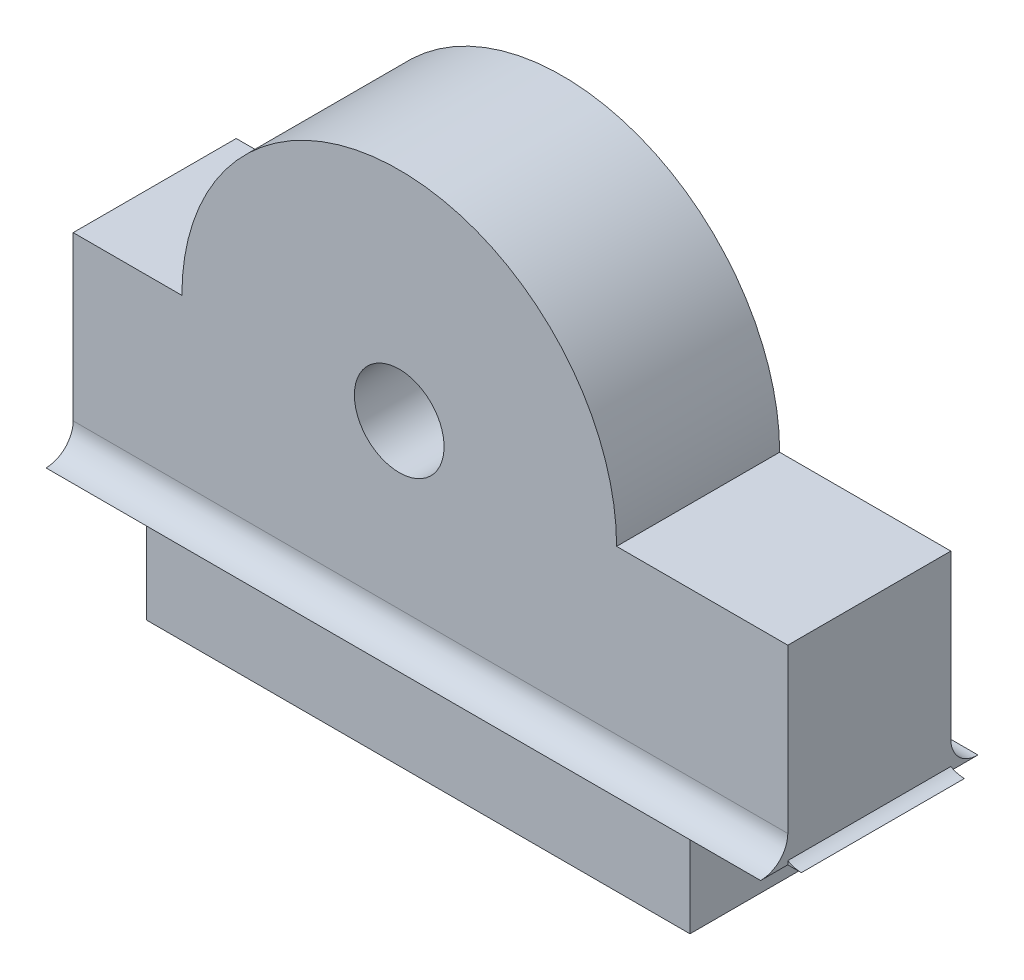
ISO-10303-21;
HEADER;
FILE_DESCRIPTION(('STEP AP214'),'2;1');
FILE_NAME('part.step','',(''),(''),'','','');
FILE_SCHEMA(('AUTOMOTIVE_DESIGN { 1 0 10303 214 1 1 1 1 }'));
ENDSEC;
DATA;
#1=APPLICATION_CONTEXT('core data for automotive mechanical design processes');
#2=APPLICATION_PROTOCOL_DEFINITION('international standard','automotive_design',2000,#1);
#3=PRODUCT_CONTEXT('',#1,'mechanical');
#4=PRODUCT('Part','Part','',(#3));
#5=PRODUCT_RELATED_PRODUCT_CATEGORY('part','',(#4));
#6=PRODUCT_DEFINITION_FORMATION('','',#4);
#7=PRODUCT_DEFINITION_CONTEXT('part definition',#1,'design');
#8=PRODUCT_DEFINITION('design','',#6,#7);
#9=PRODUCT_DEFINITION_SHAPE('','',#8);
#10=(LENGTH_UNIT() NAMED_UNIT(*) SI_UNIT(.MILLI.,.METRE.));
#11=(NAMED_UNIT(*) PLANE_ANGLE_UNIT() SI_UNIT($,.RADIAN.));
#12=(NAMED_UNIT(*) SI_UNIT($,.STERADIAN.) SOLID_ANGLE_UNIT());
#13=UNCERTAINTY_MEASURE_WITH_UNIT(LENGTH_MEASURE(1.E-05),#10,'distance_accuracy_value','');
#14=(GEOMETRIC_REPRESENTATION_CONTEXT(3) GLOBAL_UNCERTAINTY_ASSIGNED_CONTEXT((#13)) GLOBAL_UNIT_ASSIGNED_CONTEXT((#10,
#11,#12)) REPRESENTATION_CONTEXT('',''));
#15=CARTESIAN_POINT('',(0.,0.,0.));
#16=DIRECTION('',(0.,0.,1.));
#17=DIRECTION('',(1.,0.,0.));
#18=AXIS2_PLACEMENT_3D('',#15,#16,#17);
#19=CARTESIAN_POINT('',(9.3,11.,0.));
#20=DIRECTION('',(0.,0.,1.));
#21=DIRECTION('',(1.,0.,0.));
#22=AXIS2_PLACEMENT_3D('',#19,#20,#21);
#23=PLANE('',#22);
#24=CARTESIAN_POINT('',(9.3,11.,0.));
#25=DIRECTION('',(0.,0.,1.));
#26=DIRECTION('',(1.,0.,0.));
#27=AXIS2_PLACEMENT_3D('',#24,#25,#26);
#28=CIRCLE('',#27,2.9);
#29=CARTESIAN_POINT('',(12.2,11.,0.));
#30=VERTEX_POINT('',#29);
#31=EDGE_CURVE('E217',#30,#30,#28,.T.);
#32=ORIENTED_EDGE('',*,*,#31,.T.);
#33=EDGE_LOOP('',(#32));
#34=FACE_BOUND('',#33,.T.);
#35=DIRECTION('',(-1.,0.,0.));
#36=VECTOR('',#35,1.);
#37=CARTESIAN_POINT('',(25.0142135623731,5.,0.));
#38=LINE('',#37,#36);
#39=CARTESIAN_POINT('',(23.6,5.,0.));
#40=VERTEX_POINT('',#39);
#41=CARTESIAN_POINT('',(23.1,5.,0.));
#42=VERTEX_POINT('',#41);
#43=EDGE_CURVE('E191',#40,#42,#38,.T.);
#44=ORIENTED_EDGE('',*,*,#43,.T.);
#45=CARTESIAN_POINT('',(-1.49999999999999,5.,0.));
#46=VERTEX_POINT('',#45);
#47=EDGE_CURVE('E197',#42,#46,#38,.T.);
#48=ORIENTED_EDGE('',*,*,#47,.T.);
#49=CARTESIAN_POINT('',(-2.7,5.,0.));
#50=VERTEX_POINT('',#49);
#51=EDGE_CURVE('E58',#46,#50,#38,.T.);
#52=ORIENTED_EDGE('',*,*,#51,.T.);
#53=DIRECTION('',(0.,-1.,0.));
#54=VECTOR('',#53,1.);
#55=CARTESIAN_POINT('',(-2.7,4.,0.));
#56=LINE('',#55,#54);
#57=CARTESIAN_POINT('',(-2.70000000000001,11.,0.));
#58=VERTEX_POINT('',#57);
#59=EDGE_CURVE('E225',#58,#50,#56,.T.);
#60=ORIENTED_EDGE('',*,*,#59,.F.);
#61=DIRECTION('',(-1.,0.,0.));
#62=VECTOR('',#61,1.);
#63=CARTESIAN_POINT('',(-2.70000000000001,11.,0.));
#64=LINE('',#63,#62);
#65=CARTESIAN_POINT('',(1.29999999999999,11.,0.));
#66=VERTEX_POINT('',#65);
#67=EDGE_CURVE('E253',#66,#58,#64,.T.);
#68=ORIENTED_EDGE('',*,*,#67,.F.);
#69=CARTESIAN_POINT('',(9.3,11.,0.));
#70=DIRECTION('',(0.,0.,1.));
#71=DIRECTION('',(1.,0.,0.));
#72=AXIS2_PLACEMENT_3D('',#69,#70,#71);
#73=CIRCLE('',#72,8.);
#74=CARTESIAN_POINT('',(17.3,11.,0.));
#75=VERTEX_POINT('',#74);
#76=EDGE_CURVE('E251',#75,#66,#73,.T.);
#77=ORIENTED_EDGE('',*,*,#76,.F.);
#78=DIRECTION('',(-1.,0.,0.));
#79=VECTOR('',#78,1.);
#80=CARTESIAN_POINT('',(17.3,11.,0.));
#81=LINE('',#80,#79);
#82=CARTESIAN_POINT('',(23.6,11.,0.));
#83=VERTEX_POINT('',#82);
#84=EDGE_CURVE('E249',#83,#75,#81,.T.);
#85=ORIENTED_EDGE('',*,*,#84,.F.);
#86=DIRECTION('',(0.,1.,0.));
#87=VECTOR('',#86,1.);
#88=CARTESIAN_POINT('',(23.6,11.,0.));
#89=LINE('',#88,#87);
#90=EDGE_CURVE('E247',#40,#83,#89,.T.);
#91=ORIENTED_EDGE('',*,*,#90,.F.);
#92=EDGE_LOOP('',(#44,#48,#52,#60,#68,#77,#85,#91));
#93=FACE_BOUND('',#92,.T.);
#94=ADVANCED_FACE('F35',(#34,#93),#23,.F.);
#95=CARTESIAN_POINT('',(9.3,11.,6.));
#96=DIRECTION('',(0.,0.,1.));
#97=DIRECTION('',(1.,0.,0.));
#98=AXIS2_PLACEMENT_3D('',#95,#96,#97);
#99=PLANE('',#98);
#100=DIRECTION('',(0.,-1.,0.));
#101=VECTOR('',#100,1.);
#102=CARTESIAN_POINT('',(-2.7,4.,6.));
#103=LINE('',#102,#101);
#104=CARTESIAN_POINT('',(-2.70000000000001,11.,6.));
#105=VERTEX_POINT('',#104);
#106=CARTESIAN_POINT('',(-2.7,5.,6.));
#107=VERTEX_POINT('',#106);
#108=EDGE_CURVE('E237',#105,#107,#103,.T.);
#109=ORIENTED_EDGE('',*,*,#108,.T.);
#110=DIRECTION('',(-1.,0.,0.));
#111=VECTOR('',#110,1.);
#112=CARTESIAN_POINT('',(25.0142135623731,5.,6.));
#113=LINE('',#112,#111);
#114=CARTESIAN_POINT('',(-1.49999999999999,5.,6.));
#115=VERTEX_POINT('',#114);
#116=EDGE_CURVE('E50',#115,#107,#113,.T.);
#117=ORIENTED_EDGE('',*,*,#116,.F.);
#118=CARTESIAN_POINT('',(23.1,5.,6.));
#119=VERTEX_POINT('',#118);
#120=EDGE_CURVE('E212',#119,#115,#113,.T.);
#121=ORIENTED_EDGE('',*,*,#120,.F.);
#122=CARTESIAN_POINT('',(23.6,5.,6.));
#123=VERTEX_POINT('',#122);
#124=EDGE_CURVE('E209',#123,#119,#113,.T.);
#125=ORIENTED_EDGE('',*,*,#124,.F.);
#126=DIRECTION('',(0.,1.,0.));
#127=VECTOR('',#126,1.);
#128=CARTESIAN_POINT('',(23.6,11.,6.));
#129=LINE('',#128,#127);
#130=CARTESIAN_POINT('',(23.6,11.,6.));
#131=VERTEX_POINT('',#130);
#132=EDGE_CURVE('E229',#123,#131,#129,.T.);
#133=ORIENTED_EDGE('',*,*,#132,.T.);
#134=DIRECTION('',(-1.,0.,0.));
#135=VECTOR('',#134,1.);
#136=CARTESIAN_POINT('',(17.3,11.,6.));
#137=LINE('',#136,#135);
#138=CARTESIAN_POINT('',(17.3,11.,6.));
#139=VERTEX_POINT('',#138);
#140=EDGE_CURVE('E231',#131,#139,#137,.T.);
#141=ORIENTED_EDGE('',*,*,#140,.T.);
#142=CARTESIAN_POINT('',(9.3,11.,6.));
#143=DIRECTION('',(0.,0.,1.));
#144=DIRECTION('',(1.,0.,0.));
#145=AXIS2_PLACEMENT_3D('',#142,#143,#144);
#146=CIRCLE('',#145,8.);
#147=CARTESIAN_POINT('',(1.29999999999999,11.,6.));
#148=VERTEX_POINT('',#147);
#149=EDGE_CURVE('E233',#139,#148,#146,.T.);
#150=ORIENTED_EDGE('',*,*,#149,.T.);
#151=DIRECTION('',(-1.,0.,0.));
#152=VECTOR('',#151,1.);
#153=CARTESIAN_POINT('',(-2.70000000000001,11.,6.));
#154=LINE('',#153,#152);
#155=EDGE_CURVE('E235',#148,#105,#154,.T.);
#156=ORIENTED_EDGE('',*,*,#155,.T.);
#157=EDGE_LOOP('',(#109,#117,#121,#125,#133,#141,#150,#156));
#158=FACE_BOUND('',#157,.T.);
#159=CARTESIAN_POINT('',(9.3,11.,6.));
#160=DIRECTION('',(0.,0.,-1.));
#161=DIRECTION('',(-1.,0.,0.));
#162=AXIS2_PLACEMENT_3D('',#159,#160,#161);
#163=CIRCLE('',#162,1.65);
#164=CARTESIAN_POINT('',(7.65,11.,6.));
#165=VERTEX_POINT('',#164);
#166=EDGE_CURVE('E487',#165,#165,#163,.T.);
#167=ORIENTED_EDGE('',*,*,#166,.T.);
#168=EDGE_LOOP('',(#167));
#169=FACE_BOUND('',#168,.T.);
#170=ADVANCED_FACE('F301',(#158,#169),#99,.T.);
#171=DIRECTION('',(-1.,0.,0.));
#172=VECTOR('',#171,1.);
#173=CARTESIAN_POINT('',(25.0142135623731,4.,6.));
#174=LINE('',#173,#172);
#175=CARTESIAN_POINT('',(20.,4.,6.));
#176=VERTEX_POINT('',#175);
#177=CARTESIAN_POINT('',(0.,4.,6.));
#178=VERTEX_POINT('',#177);
#179=EDGE_CURVE('E205',#176,#178,#174,.T.);
#180=ORIENTED_EDGE('',*,*,#179,.T.);
#181=DIRECTION('',(0.,-1.,0.));
#182=VECTOR('',#181,1.);
#183=CARTESIAN_POINT('',(0.,0.,6.));
#184=LINE('',#183,#182);
#185=CARTESIAN_POINT('',(0.,0.,6.));
#186=VERTEX_POINT('',#185);
#187=EDGE_CURVE('E221',#178,#186,#184,.T.);
#188=ORIENTED_EDGE('',*,*,#187,.T.);
#189=DIRECTION('',(1.,0.,0.));
#190=VECTOR('',#189,1.);
#191=CARTESIAN_POINT('',(0.,0.,6.));
#192=LINE('',#191,#190);
#193=CARTESIAN_POINT('',(20.,0.,6.));
#194=VERTEX_POINT('',#193);
#195=EDGE_CURVE('E224',#186,#194,#192,.T.);
#196=ORIENTED_EDGE('',*,*,#195,.T.);
#197=DIRECTION('',(0.,1.,0.));
#198=VECTOR('',#197,1.);
#199=CARTESIAN_POINT('',(20.,0.,6.));
#200=LINE('',#199,#198);
#201=EDGE_CURVE('E227',#194,#176,#200,.T.);
#202=ORIENTED_EDGE('',*,*,#201,.T.);
#203=EDGE_LOOP('',(#180,#188,#196,#202));
#204=FACE_BOUND('',#203,.T.);
#205=ADVANCED_FACE('F299',(#204),#99,.T.);
#206=DIRECTION('',(0.,-1.,0.));
#207=VECTOR('',#206,1.);
#208=CARTESIAN_POINT('',(0.,0.,0.));
#209=LINE('',#208,#207);
#210=CARTESIAN_POINT('',(0.,4.,0.));
#211=VERTEX_POINT('',#210);
#212=CARTESIAN_POINT('',(0.,0.,0.));
#213=VERTEX_POINT('',#212);
#214=EDGE_CURVE('E220',#211,#213,#209,.T.);
#215=ORIENTED_EDGE('',*,*,#214,.F.);
#216=DIRECTION('',(-1.,0.,0.));
#217=VECTOR('',#216,1.);
#218=CARTESIAN_POINT('',(25.0142135623731,4.,0.));
#219=LINE('',#218,#217);
#220=CARTESIAN_POINT('',(20.,4.,0.));
#221=VERTEX_POINT('',#220);
#222=EDGE_CURVE('E198',#221,#211,#219,.T.);
#223=ORIENTED_EDGE('',*,*,#222,.F.);
#224=DIRECTION('',(0.,1.,0.));
#225=VECTOR('',#224,1.);
#226=CARTESIAN_POINT('',(20.,0.,0.));
#227=LINE('',#226,#225);
#228=CARTESIAN_POINT('',(20.,0.,0.));
#229=VERTEX_POINT('',#228);
#230=EDGE_CURVE('E244',#229,#221,#227,.T.);
#231=ORIENTED_EDGE('',*,*,#230,.F.);
#232=DIRECTION('',(1.,0.,0.));
#233=VECTOR('',#232,1.);
#234=CARTESIAN_POINT('',(0.,0.,0.));
#235=LINE('',#234,#233);
#236=EDGE_CURVE('E242',#213,#229,#235,.T.);
#237=ORIENTED_EDGE('',*,*,#236,.F.);
#238=EDGE_LOOP('',(#215,#223,#231,#237));
#239=FACE_BOUND('',#238,.T.);
#240=ADVANCED_FACE('F290',(#239),#23,.F.);
#241=CARTESIAN_POINT('',(0.,0.,6.));
#242=DIRECTION('',(1.,0.,0.));
#243=DIRECTION('',(0.,0.,-1.));
#244=AXIS2_PLACEMENT_3D('',#241,#242,#243);
#245=PLANE('',#244);
#246=ORIENTED_EDGE('',*,*,#214,.T.);
#247=DIRECTION('',(0.,0.,-1.));
#248=VECTOR('',#247,1.);
#249=CARTESIAN_POINT('',(0.,0.,6.));
#250=LINE('',#249,#248);
#251=EDGE_CURVE('E43',#186,#213,#250,.T.);
#252=ORIENTED_EDGE('',*,*,#251,.F.);
#253=ORIENTED_EDGE('',*,*,#187,.F.);
#254=DIRECTION('',(0.,0.,-1.));
#255=VECTOR('',#254,1.);
#256=CARTESIAN_POINT('',(0.,4.,6.));
#257=LINE('',#256,#255);
#258=EDGE_CURVE('E239',#178,#211,#257,.T.);
#259=ORIENTED_EDGE('',*,*,#258,.T.);
#260=EDGE_LOOP('',(#246,#252,#253,#259));
#261=FACE_BOUND('',#260,.T.);
#262=ADVANCED_FACE('F37',(#261),#245,.F.);
#263=CARTESIAN_POINT('',(0.,0.,6.));
#264=DIRECTION('',(0.,1.,0.));
#265=DIRECTION('',(0.,0.,1.));
#266=AXIS2_PLACEMENT_3D('',#263,#264,#265);
#267=PLANE('',#266);
#268=ORIENTED_EDGE('',*,*,#236,.T.);
#269=DIRECTION('',(0.,0.,-1.));
#270=VECTOR('',#269,1.);
#271=CARTESIAN_POINT('',(20.,0.,6.));
#272=LINE('',#271,#270);
#273=EDGE_CURVE('E279',#194,#229,#272,.T.);
#274=ORIENTED_EDGE('',*,*,#273,.F.);
#275=ORIENTED_EDGE('',*,*,#195,.F.);
#276=ORIENTED_EDGE('',*,*,#251,.T.);
#277=EDGE_LOOP('',(#268,#274,#275,#276));
#278=FACE_BOUND('',#277,.T.);
#279=ADVANCED_FACE('F284',(#278),#267,.F.);
#280=CARTESIAN_POINT('',(20.,0.,6.));
#281=DIRECTION('',(-1.,0.,0.));
#282=DIRECTION('',(0.,0.,1.));
#283=AXIS2_PLACEMENT_3D('',#280,#281,#282);
#284=PLANE('',#283);
#285=ORIENTED_EDGE('',*,*,#230,.T.);
#286=DIRECTION('',(0.,0.,-1.));
#287=VECTOR('',#286,1.);
#288=CARTESIAN_POINT('',(20.,4.,6.));
#289=LINE('',#288,#287);
#290=EDGE_CURVE('E276',#176,#221,#289,.T.);
#291=ORIENTED_EDGE('',*,*,#290,.F.);
#292=ORIENTED_EDGE('',*,*,#201,.F.);
#293=ORIENTED_EDGE('',*,*,#273,.T.);
#294=EDGE_LOOP('',(#285,#291,#292,#293));
#295=FACE_BOUND('',#294,.T.);
#296=ADVANCED_FACE('F294',(#295),#284,.F.);
#297=CARTESIAN_POINT('',(23.6,11.,6.));
#298=DIRECTION('',(-1.,0.,0.));
#299=DIRECTION('',(0.,-1.,0.));
#300=AXIS2_PLACEMENT_3D('',#297,#298,#299);
#301=PLANE('',#300);
#302=DIRECTION('',(0.,0.,-1.));
#303=VECTOR('',#302,1.);
#304=CARTESIAN_POINT('',(23.6,4.,6.));
#305=LINE('',#304,#303);
#306=CARTESIAN_POINT('',(23.6,4.,7.));
#307=VERTEX_POINT('',#306);
#308=CARTESIAN_POINT('',(23.6,4.,6.));
#309=VERTEX_POINT('',#308);
#310=EDGE_CURVE('E274',#307,#309,#305,.T.);
#311=ORIENTED_EDGE('',*,*,#310,.T.);
#312=DIRECTION('',(0.,1.,0.));
#313=VECTOR('',#312,1.);
#314=CARTESIAN_POINT('',(23.6,11.,6.));
#315=LINE('',#314,#313);
#316=CARTESIAN_POINT('',(23.6,4.13397459621557,6.));
#317=VERTEX_POINT('',#316);
#318=EDGE_CURVE('E160',#309,#317,#315,.T.);
#319=ORIENTED_EDGE('',*,*,#318,.T.);
#320=DIRECTION('',(0.,0.,1.));
#321=VECTOR('',#320,1.);
#322=CARTESIAN_POINT('',(23.6,4.13397459621557,-1.4142135623731));
#323=LINE('',#322,#321);
#324=CARTESIAN_POINT('',(23.6,4.13397459621557,0.));
#325=VERTEX_POINT('',#324);
#326=EDGE_CURVE('E176',#317,#325,#323,.F.);
#327=ORIENTED_EDGE('',*,*,#326,.T.);
#328=DIRECTION('',(0.,1.,0.));
#329=VECTOR('',#328,1.);
#330=CARTESIAN_POINT('',(23.6,11.,0.));
#331=LINE('',#330,#329);
#332=CARTESIAN_POINT('',(23.6,4.,0.));
#333=VERTEX_POINT('',#332);
#334=EDGE_CURVE('E182',#333,#325,#331,.T.);
#335=ORIENTED_EDGE('',*,*,#334,.F.);
#336=CARTESIAN_POINT('',(23.6,4.,-1.));
#337=VERTEX_POINT('',#336);
#338=EDGE_CURVE('E273',#333,#337,#305,.T.);
#339=ORIENTED_EDGE('',*,*,#338,.T.);
#340=CARTESIAN_POINT('',(23.6,5.,-1.));
#341=DIRECTION('',(-1.,0.,0.));
#342=DIRECTION('',(0.,-1.,0.));
#343=AXIS2_PLACEMENT_3D('',#340,#341,#342);
#344=CIRCLE('',#343,1.);
#345=EDGE_CURVE('E188',#337,#40,#344,.T.);
#346=ORIENTED_EDGE('',*,*,#345,.T.);
#347=ORIENTED_EDGE('',*,*,#90,.T.);
#348=DIRECTION('',(0.,0.,-1.));
#349=VECTOR('',#348,1.);
#350=CARTESIAN_POINT('',(23.6,11.,6.));
#351=LINE('',#350,#349);
#352=EDGE_CURVE('E270',#131,#83,#351,.T.);
#353=ORIENTED_EDGE('',*,*,#352,.F.);
#354=ORIENTED_EDGE('',*,*,#132,.F.);
#355=CARTESIAN_POINT('',(23.6,5.,7.));
#356=DIRECTION('',(-1.,0.,0.));
#357=DIRECTION('',(0.,-1.,0.));
#358=AXIS2_PLACEMENT_3D('',#355,#356,#357);
#359=CIRCLE('',#358,1.);
#360=EDGE_CURVE('E208',#123,#307,#359,.T.);
#361=ORIENTED_EDGE('',*,*,#360,.T.);
#362=EDGE_LOOP('',(#311,#319,#327,#335,#339,#346,#347,#353,#354,#361));
#363=FACE_BOUND('',#362,.T.);
#364=ADVANCED_FACE('F333',(#363),#301,.F.);
#365=CARTESIAN_POINT('',(17.3,11.,6.));
#366=DIRECTION('',(0.,-1.,0.));
#367=DIRECTION('',(0.,0.,-1.));
#368=AXIS2_PLACEMENT_3D('',#365,#366,#367);
#369=PLANE('',#368);
#370=ORIENTED_EDGE('',*,*,#84,.T.);
#371=DIRECTION('',(0.,0.,-1.));
#372=VECTOR('',#371,1.);
#373=CARTESIAN_POINT('',(17.3,11.,6.));
#374=LINE('',#373,#372);
#375=EDGE_CURVE('E267',#139,#75,#374,.T.);
#376=ORIENTED_EDGE('',*,*,#375,.F.);
#377=ORIENTED_EDGE('',*,*,#140,.F.);
#378=ORIENTED_EDGE('',*,*,#352,.T.);
#379=EDGE_LOOP('',(#370,#376,#377,#378));
#380=FACE_BOUND('',#379,.T.);
#381=ADVANCED_FACE('F329',(#380),#369,.F.);
#382=CARTESIAN_POINT('',(9.3,11.,6.));
#383=DIRECTION('',(0.,0.,-1.));
#384=DIRECTION('',(-1.,0.,0.));
#385=AXIS2_PLACEMENT_3D('',#382,#383,#384);
#386=CYLINDRICAL_SURFACE('',#385,8.);
#387=ORIENTED_EDGE('',*,*,#76,.T.);
#388=DIRECTION('',(0.,0.,-1.));
#389=VECTOR('',#388,1.);
#390=CARTESIAN_POINT('',(1.29999999999999,11.,6.));
#391=LINE('',#390,#389);
#392=EDGE_CURVE('E264',#148,#66,#391,.T.);
#393=ORIENTED_EDGE('',*,*,#392,.F.);
#394=ORIENTED_EDGE('',*,*,#149,.F.);
#395=ORIENTED_EDGE('',*,*,#375,.T.);
#396=EDGE_LOOP('',(#387,#393,#394,#395));
#397=FACE_BOUND('',#396,.T.);
#398=ADVANCED_FACE('F325',(#397),#386,.T.);
#399=CARTESIAN_POINT('',(-2.70000000000001,11.,6.));
#400=DIRECTION('',(0.,-1.,0.));
#401=DIRECTION('',(0.,0.,-1.));
#402=AXIS2_PLACEMENT_3D('',#399,#400,#401);
#403=PLANE('',#402);
#404=ORIENTED_EDGE('',*,*,#67,.T.);
#405=DIRECTION('',(0.,0.,-1.));
#406=VECTOR('',#405,1.);
#407=CARTESIAN_POINT('',(-2.70000000000001,11.,6.));
#408=LINE('',#407,#406);
#409=EDGE_CURVE('E261',#105,#58,#408,.T.);
#410=ORIENTED_EDGE('',*,*,#409,.F.);
#411=ORIENTED_EDGE('',*,*,#155,.F.);
#412=ORIENTED_EDGE('',*,*,#392,.T.);
#413=EDGE_LOOP('',(#404,#410,#411,#412));
#414=FACE_BOUND('',#413,.T.);
#415=ADVANCED_FACE('F321',(#414),#403,.F.);
#416=CARTESIAN_POINT('',(-2.7,4.,6.));
#417=DIRECTION('',(1.,0.,0.));
#418=DIRECTION('',(0.,1.,0.));
#419=AXIS2_PLACEMENT_3D('',#416,#417,#418);
#420=PLANE('',#419);
#421=ORIENTED_EDGE('',*,*,#59,.T.);
#422=CARTESIAN_POINT('',(-2.7,5.,-1.));
#423=DIRECTION('',(1.,0.,0.));
#424=DIRECTION('',(0.,0.,-1.));
#425=AXIS2_PLACEMENT_3D('',#422,#423,#424);
#426=CIRCLE('',#425,1.);
#427=CARTESIAN_POINT('',(-2.7,4.,-1.));
#428=VERTEX_POINT('',#427);
#429=EDGE_CURVE('E187',#50,#428,#426,.T.);
#430=ORIENTED_EDGE('',*,*,#429,.T.);
#431=DIRECTION('',(0.,0.,-1.));
#432=VECTOR('',#431,1.);
#433=CARTESIAN_POINT('',(-2.7,4.,6.));
#434=LINE('',#433,#432);
#435=CARTESIAN_POINT('',(-2.7,4.,7.));
#436=VERTEX_POINT('',#435);
#437=EDGE_CURVE('E259',#436,#428,#434,.T.);
#438=ORIENTED_EDGE('',*,*,#437,.F.);
#439=CARTESIAN_POINT('',(-2.7,5.,7.));
#440=DIRECTION('',(1.,0.,0.));
#441=DIRECTION('',(0.,0.,1.));
#442=AXIS2_PLACEMENT_3D('',#439,#440,#441);
#443=CIRCLE('',#442,1.);
#444=EDGE_CURVE('E190',#436,#107,#443,.T.);
#445=ORIENTED_EDGE('',*,*,#444,.T.);
#446=ORIENTED_EDGE('',*,*,#108,.F.);
#447=ORIENTED_EDGE('',*,*,#409,.T.);
#448=EDGE_LOOP('',(#421,#430,#438,#445,#446,#447));
#449=FACE_BOUND('',#448,.T.);
#450=ADVANCED_FACE('F318',(#449),#420,.F.);
#451=CARTESIAN_POINT('',(0.,4.,6.));
#452=DIRECTION('',(0.,1.,0.));
#453=DIRECTION('',(0.,0.,1.));
#454=AXIS2_PLACEMENT_3D('',#451,#452,#453);
#455=PLANE('',#454);
#456=ORIENTED_EDGE('',*,*,#222,.T.);
#457=ORIENTED_EDGE('',*,*,#258,.F.);
#458=ORIENTED_EDGE('',*,*,#179,.F.);
#459=ORIENTED_EDGE('',*,*,#290,.T.);
#460=EDGE_LOOP('',(#456,#457,#458,#459));
#461=FACE_BOUND('',#460,.T.);
#462=ORIENTED_EDGE('',*,*,#338,.F.);
#463=DIRECTION('',(-1.,0.,0.));
#464=VECTOR('',#463,1.);
#465=CARTESIAN_POINT('',(23.1,4.,0.));
#466=LINE('',#465,#464);
#467=CARTESIAN_POINT('',(24.1,4.,0.));
#468=VERTEX_POINT('',#467);
#469=EDGE_CURVE('E170',#468,#333,#466,.T.);
#470=ORIENTED_EDGE('',*,*,#469,.F.);
#471=DIRECTION('',(0.,0.,1.));
#472=VECTOR('',#471,1.);
#473=CARTESIAN_POINT('',(24.1,4.,-1.4142135623731));
#474=LINE('',#473,#472);
#475=CARTESIAN_POINT('',(24.1,4.,6.));
#476=VERTEX_POINT('',#475);
#477=EDGE_CURVE('E166',#468,#476,#474,.T.);
#478=ORIENTED_EDGE('',*,*,#477,.T.);
#479=DIRECTION('',(1.,0.,0.));
#480=VECTOR('',#479,1.);
#481=CARTESIAN_POINT('',(23.1,4.,6.));
#482=LINE('',#481,#480);
#483=EDGE_CURVE('E155',#309,#476,#482,.T.);
#484=ORIENTED_EDGE('',*,*,#483,.F.);
#485=ORIENTED_EDGE('',*,*,#310,.F.);
#486=DIRECTION('',(-1.,0.,0.));
#487=VECTOR('',#486,1.);
#488=CARTESIAN_POINT('',(25.0142135623731,4.,7.));
#489=LINE('',#488,#487);
#490=EDGE_CURVE('E204',#307,#436,#489,.T.);
#491=ORIENTED_EDGE('',*,*,#490,.T.);
#492=ORIENTED_EDGE('',*,*,#437,.T.);
#493=DIRECTION('',(-1.,0.,0.));
#494=VECTOR('',#493,1.);
#495=CARTESIAN_POINT('',(25.0142135623731,4.,-1.));
#496=LINE('',#495,#494);
#497=EDGE_CURVE('E194',#337,#428,#496,.T.);
#498=ORIENTED_EDGE('',*,*,#497,.F.);
#499=EDGE_LOOP('',(#462,#470,#478,#484,#485,#491,#492,#498));
#500=FACE_BOUND('',#499,.T.);
#501=ADVANCED_FACE('F168',(#461,#500),#455,.F.);
#502=CARTESIAN_POINT('',(9.3,11.,6.));
#503=DIRECTION('',(0.,0.,-1.));
#504=DIRECTION('',(-1.,0.,0.));
#505=AXIS2_PLACEMENT_3D('',#502,#503,#504);
#506=CYLINDRICAL_SURFACE('',#505,2.9);
#507=CARTESIAN_POINT('',(9.3,11.,3.));
#508=DIRECTION('',(0.,0.,-1.));
#509=DIRECTION('',(-1.,0.,0.));
#510=AXIS2_PLACEMENT_3D('',#507,#508,#509);
#511=CIRCLE('',#510,2.9);
#512=CARTESIAN_POINT('',(6.4,11.,3.));
#513=VERTEX_POINT('',#512);
#514=EDGE_CURVE('E11',#513,#513,#511,.T.);
#515=ORIENTED_EDGE('',*,*,#514,.F.);
#516=EDGE_LOOP('',(#515));
#517=FACE_BOUND('',#516,.T.);
#518=ORIENTED_EDGE('',*,*,#31,.F.);
#519=EDGE_LOOP('',(#518));
#520=FACE_BOUND('',#519,.T.);
#521=ADVANCED_FACE('F317',(#517,#520),#506,.F.);
#522=CARTESIAN_POINT('',(25.0142135623731,5.,7.));
#523=DIRECTION('',(-1.,0.,0.));
#524=DIRECTION('',(0.,0.,1.));
#525=AXIS2_PLACEMENT_3D('',#522,#523,#524);
#526=CYLINDRICAL_SURFACE('',#525,1.);
#527=ORIENTED_EDGE('',*,*,#360,.F.);
#528=ORIENTED_EDGE('',*,*,#124,.T.);
#529=ORIENTED_EDGE('',*,*,#120,.T.);
#530=ORIENTED_EDGE('',*,*,#116,.T.);
#531=ORIENTED_EDGE('',*,*,#444,.F.);
#532=ORIENTED_EDGE('',*,*,#490,.F.);
#533=EDGE_LOOP('',(#527,#528,#529,#530,#531,#532));
#534=FACE_BOUND('',#533,.T.);
#535=ADVANCED_FACE('F428',(#534),#526,.F.);
#536=CARTESIAN_POINT('',(25.0142135623731,5.,-1.));
#537=DIRECTION('',(-1.,0.,0.));
#538=DIRECTION('',(0.,0.,1.));
#539=AXIS2_PLACEMENT_3D('',#536,#537,#538);
#540=CYLINDRICAL_SURFACE('',#539,1.);
#541=ORIENTED_EDGE('',*,*,#345,.F.);
#542=ORIENTED_EDGE('',*,*,#497,.T.);
#543=ORIENTED_EDGE('',*,*,#429,.F.);
#544=ORIENTED_EDGE('',*,*,#51,.F.);
#545=ORIENTED_EDGE('',*,*,#47,.F.);
#546=ORIENTED_EDGE('',*,*,#43,.F.);
#547=EDGE_LOOP('',(#541,#542,#543,#544,#545,#546));
#548=FACE_BOUND('',#547,.T.);
#549=ADVANCED_FACE('F463',(#548),#540,.F.);
#550=CARTESIAN_POINT('',(24.1,5.,6.));
#551=DIRECTION('',(0.,0.,1.));
#552=DIRECTION('',(1.,0.,0.));
#553=AXIS2_PLACEMENT_3D('',#550,#551,#552);
#554=PLANE('',#553);
#555=ORIENTED_EDGE('',*,*,#318,.F.);
#556=ORIENTED_EDGE('',*,*,#483,.T.);
#557=CARTESIAN_POINT('',(24.1,5.,6.));
#558=DIRECTION('',(0.,0.,-1.));
#559=DIRECTION('',(1.,0.,0.));
#560=AXIS2_PLACEMENT_3D('',#557,#558,#559);
#561=CIRCLE('',#560,1.);
#562=EDGE_CURVE('E159',#476,#317,#561,.T.);
#563=ORIENTED_EDGE('',*,*,#562,.T.);
#564=EDGE_LOOP('',(#555,#556,#563));
#565=FACE_BOUND('',#564,.T.);
#566=ADVANCED_FACE('F157',(#565),#554,.T.);
#567=CARTESIAN_POINT('',(24.1,5.,-1.4142135623731));
#568=DIRECTION('',(0.,0.,1.));
#569=DIRECTION('',(1.,0.,0.));
#570=AXIS2_PLACEMENT_3D('',#567,#568,#569);
#571=CYLINDRICAL_SURFACE('',#570,1.);
#572=ORIENTED_EDGE('',*,*,#326,.F.);
#573=ORIENTED_EDGE('',*,*,#562,.F.);
#574=ORIENTED_EDGE('',*,*,#477,.F.);
#575=CARTESIAN_POINT('',(24.1,5.,0.));
#576=DIRECTION('',(0.,0.,1.));
#577=DIRECTION('',(1.,0.,0.));
#578=AXIS2_PLACEMENT_3D('',#575,#576,#577);
#579=CIRCLE('',#578,1.);
#580=EDGE_CURVE('E180',#325,#468,#579,.T.);
#581=ORIENTED_EDGE('',*,*,#580,.F.);
#582=EDGE_LOOP('',(#572,#573,#574,#581));
#583=FACE_BOUND('',#582,.T.);
#584=ADVANCED_FACE('F175',(#583),#571,.F.);
#585=CARTESIAN_POINT('',(9.3,11.,0.));
#586=DIRECTION('',(0.,0.,1.));
#587=DIRECTION('',(1.,0.,0.));
#588=AXIS2_PLACEMENT_3D('',#585,#586,#587);
#589=PLANE('',#588);
#590=ORIENTED_EDGE('',*,*,#469,.T.);
#591=ORIENTED_EDGE('',*,*,#334,.T.);
#592=ORIENTED_EDGE('',*,*,#580,.T.);
#593=EDGE_LOOP('',(#590,#591,#592));
#594=FACE_BOUND('',#593,.T.);
#595=ADVANCED_FACE('F441',(#594),#589,.F.);
#596=CARTESIAN_POINT('',(9.3,11.,3.));
#597=DIRECTION('',(0.,0.,-1.));
#598=DIRECTION('',(-1.,0.,0.));
#599=AXIS2_PLACEMENT_3D('',#596,#597,#598);
#600=PLANE('',#599);
#601=ORIENTED_EDGE('',*,*,#514,.T.);
#602=EDGE_LOOP('',(#601));
#603=FACE_BOUND('',#602,.T.);
#604=CARTESIAN_POINT('',(9.3,11.,3.));
#605=DIRECTION('',(0.,0.,-1.));
#606=DIRECTION('',(-1.,0.,0.));
#607=AXIS2_PLACEMENT_3D('',#604,#605,#606);
#608=CIRCLE('',#607,1.65);
#609=CARTESIAN_POINT('',(7.65,11.,3.));
#610=VERTEX_POINT('',#609);
#611=EDGE_CURVE('E162',#610,#610,#608,.T.);
#612=ORIENTED_EDGE('',*,*,#611,.F.);
#613=EDGE_LOOP('',(#612));
#614=FACE_BOUND('',#613,.T.);
#615=ADVANCED_FACE('F436',(#603,#614),#600,.T.);
#616=CARTESIAN_POINT('',(9.3,11.,3.));
#617=DIRECTION('',(0.,0.,1.));
#618=DIRECTION('',(1.,0.,0.));
#619=AXIS2_PLACEMENT_3D('',#616,#617,#618);
#620=CYLINDRICAL_SURFACE('',#619,1.65);
#621=ORIENTED_EDGE('',*,*,#611,.T.);
#622=EDGE_LOOP('',(#621));
#623=FACE_BOUND('',#622,.T.);
#624=ORIENTED_EDGE('',*,*,#166,.F.);
#625=EDGE_LOOP('',(#624));
#626=FACE_BOUND('',#625,.T.);
#627=ADVANCED_FACE('F440',(#623,#626),#620,.F.);
#628=CLOSED_SHELL('',(#94,#170,#205,#240,#262,#279,#296,#364,#381,#398,#415,#450,#501,#521,#535,
#549,#566,#584,#595,#615,#627));
#629=MANIFOLD_SOLID_BREP('B2',#628);
#630=ADVANCED_BREP_SHAPE_REPRESENTATION('',(#18,#629),#14);
#631=SHAPE_DEFINITION_REPRESENTATION(#9,#630);
ENDSEC;
END-ISO-10303-21;
